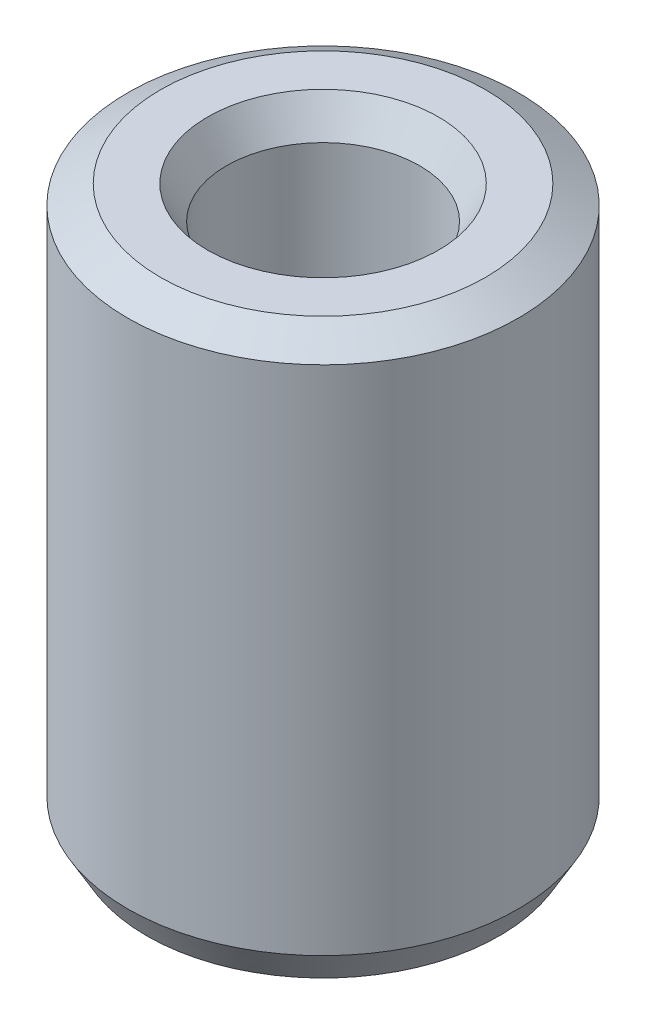
ISO-10303-21;
HEADER;
FILE_DESCRIPTION(('STEP AP214'),'2;1');
FILE_NAME('part.step','',(''),(''),'','','');
FILE_SCHEMA(('AUTOMOTIVE_DESIGN { 1 0 10303 214 1 1 1 1 }'));
ENDSEC;
DATA;
#1=APPLICATION_CONTEXT('core data for automotive mechanical design processes');
#2=APPLICATION_PROTOCOL_DEFINITION('international standard','automotive_design',2000,#1);
#3=PRODUCT_CONTEXT('',#1,'mechanical');
#4=PRODUCT('Part','Part','',(#3));
#5=PRODUCT_RELATED_PRODUCT_CATEGORY('part','',(#4));
#6=PRODUCT_DEFINITION_FORMATION('','',#4);
#7=PRODUCT_DEFINITION_CONTEXT('part definition',#1,'design');
#8=PRODUCT_DEFINITION('design','',#6,#7);
#9=PRODUCT_DEFINITION_SHAPE('','',#8);
#10=(LENGTH_UNIT() NAMED_UNIT(*) SI_UNIT(.MILLI.,.METRE.));
#11=(NAMED_UNIT(*) PLANE_ANGLE_UNIT() SI_UNIT($,.RADIAN.));
#12=(NAMED_UNIT(*) SI_UNIT($,.STERADIAN.) SOLID_ANGLE_UNIT());
#13=UNCERTAINTY_MEASURE_WITH_UNIT(LENGTH_MEASURE(1.E-05),#10,'distance_accuracy_value','');
#14=(GEOMETRIC_REPRESENTATION_CONTEXT(3) GLOBAL_UNCERTAINTY_ASSIGNED_CONTEXT((#13)) GLOBAL_UNIT_ASSIGNED_CONTEXT((#10,
#11,#12)) REPRESENTATION_CONTEXT('',''));
#15=CARTESIAN_POINT('',(0.,0.,0.));
#16=DIRECTION('',(0.,0.,1.));
#17=DIRECTION('',(1.,0.,0.));
#18=AXIS2_PLACEMENT_3D('',#15,#16,#17);
#19=CARTESIAN_POINT('',(0.,43.2676324953821,0.));
#20=DIRECTION('',(0.,-1.,0.));
#21=DIRECTION('',(0.,0.,-1.));
#22=AXIS2_PLACEMENT_3D('',#19,#20,#21);
#23=CYLINDRICAL_SURFACE('',#22,15.);
#24=CARTESIAN_POINT('',(0.,2.51737278887031,0.));
#25=DIRECTION('',(0.,1.,0.));
#26=DIRECTION('',(0.,0.,1.));
#27=AXIS2_PLACEMENT_3D('',#24,#25,#26);
#28=CIRCLE('',#27,15.);
#29=CARTESIAN_POINT('',(0.,2.51737278887031,15.));
#30=VERTEX_POINT('',#29);
#31=EDGE_CURVE('E10',#30,#30,#28,.T.);
#32=ORIENTED_EDGE('',*,*,#31,.T.);
#33=EDGE_LOOP('',(#32));
#34=FACE_BOUND('',#33,.T.);
#35=CARTESIAN_POINT('',(0.,41.8142266380772,0.));
#36=DIRECTION('',(0.,1.,0.));
#37=DIRECTION('',(0.,0.,1.));
#38=AXIS2_PLACEMENT_3D('',#35,#36,#37);
#39=CIRCLE('',#38,15.);
#40=CARTESIAN_POINT('',(0.,41.8142266380772,15.));
#41=VERTEX_POINT('',#40);
#42=EDGE_CURVE('E50',#41,#41,#39,.F.);
#43=ORIENTED_EDGE('',*,*,#42,.T.);
#44=EDGE_LOOP('',(#43));
#45=FACE_BOUND('',#44,.T.);
#46=ADVANCED_FACE('F39',(#34,#45),#23,.T.);
#47=CARTESIAN_POINT('',(0.,43.2676324953821,0.));
#48=DIRECTION('',(0.,1.,0.));
#49=DIRECTION('',(0.,0.,1.));
#50=AXIS2_PLACEMENT_3D('',#47,#48,#49);
#51=PLANE('',#50);
#52=CARTESIAN_POINT('',(0.,43.2676324953821,0.));
#53=DIRECTION('',(0.,1.,0.));
#54=DIRECTION('',(0.,0.,1.));
#55=AXIS2_PLACEMENT_3D('',#52,#53,#54);
#56=CIRCLE('',#55,8.8670238536071);
#57=CARTESIAN_POINT('',(0.,43.2676324953821,8.8670238536071));
#58=VERTEX_POINT('',#57);
#59=EDGE_CURVE('E58',#58,#58,#56,.F.);
#60=ORIENTED_EDGE('',*,*,#59,.T.);
#61=EDGE_LOOP('',(#60));
#62=FACE_BOUND('',#61,.T.);
#63=CARTESIAN_POINT('',(0.,43.2676324953821,0.));
#64=DIRECTION('',(0.,1.,0.));
#65=DIRECTION('',(0.,0.,1.));
#66=AXIS2_PLACEMENT_3D('',#63,#64,#65);
#67=CIRCLE('',#66,12.4826272111297);
#68=CARTESIAN_POINT('',(0.,43.2676324953821,12.4826272111297));
#69=VERTEX_POINT('',#68);
#70=EDGE_CURVE('E61',#69,#69,#67,.T.);
#71=ORIENTED_EDGE('',*,*,#70,.T.);
#72=EDGE_LOOP('',(#71));
#73=FACE_BOUND('',#72,.T.);
#74=ADVANCED_FACE('F88',(#62,#73),#51,.T.);
#75=CARTESIAN_POINT('',(0.,0.,0.));
#76=DIRECTION('',(0.,1.,0.));
#77=DIRECTION('',(0.,0.,1.));
#78=AXIS2_PLACEMENT_3D('',#75,#76,#77);
#79=PLANE('',#78);
#80=CARTESIAN_POINT('',(0.,0.,0.));
#81=DIRECTION('',(0.,1.,0.));
#82=DIRECTION('',(0.,0.,1.));
#83=AXIS2_PLACEMENT_3D('',#80,#81,#82);
#84=CIRCLE('',#83,9.93099078517248);
#85=CARTESIAN_POINT('',(0.,0.,-9.93099078517248));
#86=VERTEX_POINT('',#85);
#87=EDGE_CURVE('E51',#86,#86,#84,.T.);
#88=ORIENTED_EDGE('',*,*,#87,.T.);
#89=EDGE_LOOP('',(#88));
#90=FACE_BOUND('',#89,.T.);
#91=CARTESIAN_POINT('',(0.,0.,0.));
#92=DIRECTION('',(0.,1.,0.));
#93=DIRECTION('',(0.,0.,1.));
#94=AXIS2_PLACEMENT_3D('',#91,#92,#93);
#95=CIRCLE('',#94,13.5465941426951);
#96=CARTESIAN_POINT('',(0.,0.,13.5465941426951));
#97=VERTEX_POINT('',#96);
#98=EDGE_CURVE('E54',#97,#97,#95,.F.);
#99=ORIENTED_EDGE('',*,*,#98,.T.);
#100=EDGE_LOOP('',(#99));
#101=FACE_BOUND('',#100,.T.);
#102=ADVANCED_FACE('F83',(#90,#101),#79,.F.);
#103=CARTESIAN_POINT('',(0.,43.2676324953821,0.));
#104=DIRECTION('',(0.,-1.,0.));
#105=DIRECTION('',(0.,0.,-1.));
#106=AXIS2_PLACEMENT_3D('',#103,#104,#105);
#107=CYLINDRICAL_SURFACE('',#106,7.41361799630217);
#108=CARTESIAN_POINT('',(0.,40.7502597065118,0.));
#109=DIRECTION('',(0.,1.,0.));
#110=DIRECTION('',(0.,0.,1.));
#111=AXIS2_PLACEMENT_3D('',#108,#109,#110);
#112=CIRCLE('',#111,7.41361799630217);
#113=CARTESIAN_POINT('',(0.,40.7502597065118,-7.41361799630217));
#114=VERTEX_POINT('',#113);
#115=EDGE_CURVE('E67',#114,#114,#112,.T.);
#116=CARTESIAN_POINT('',(0.,1.45340585730492,0.));
#117=DIRECTION('',(0.,1.,0.));
#118=DIRECTION('',(0.,0.,1.));
#119=AXIS2_PLACEMENT_3D('',#116,#117,#118);
#120=CIRCLE('',#119,7.41361799630217);
#121=CARTESIAN_POINT('',(0.,1.45340585730491,-7.41361799630217));
#122=VERTEX_POINT('',#121);
#123=EDGE_CURVE('E69',#122,#122,#120,.F.);
#124=CARTESIAN_POINT('',(0.,40.7502597065118,-7.41361799630217));
#125=CARTESIAN_POINT('',(0.,40.3409174789159,-7.41361799630217));
#126=CARTESIAN_POINT('',(0.,39.93157525132,-7.41361799630217));
#127=CARTESIAN_POINT('',(0.,39.1128907961281,-7.41361799630217));
#128=CARTESIAN_POINT('',(0.,38.7035485685322,-7.41361799630217));
#129=CARTESIAN_POINT('',(0.,37.8848641133404,-7.41361799630217));
#130=CARTESIAN_POINT('',(0.,37.4755218857445,-7.41361799630217));
#131=CARTESIAN_POINT('',(0.,36.6568374305527,-7.41361799630217));
#132=CARTESIAN_POINT('',(0.,36.2474952029568,-7.41361799630217));
#133=CARTESIAN_POINT('',(0.,35.428810747765,-7.41361799630217));
#134=CARTESIAN_POINT('',(0.,35.0194685201691,-7.41361799630217));
#135=CARTESIAN_POINT('',(0.,34.2007840649773,-7.41361799630217));
#136=CARTESIAN_POINT('',(0.,33.7914418373814,-7.41361799630217));
#137=CARTESIAN_POINT('',(0.,32.9727573821896,-7.41361799630217));
#138=CARTESIAN_POINT('',(0.,32.5634151545937,-7.41361799630217));
#139=CARTESIAN_POINT('',(0.,31.7447306994019,-7.41361799630217));
#140=CARTESIAN_POINT('',(0.,31.335388471806,-7.41361799630217));
#141=CARTESIAN_POINT('',(0.,30.5167040166141,-7.41361799630217));
#142=CARTESIAN_POINT('',(0.,30.1073617890182,-7.41361799630217));
#143=CARTESIAN_POINT('',(0.,29.2886773338264,-7.41361799630217));
#144=CARTESIAN_POINT('',(0.,28.8793351062305,-7.41361799630217));
#145=CARTESIAN_POINT('',(0.,28.0606506510387,-7.41361799630217));
#146=CARTESIAN_POINT('',(0.,27.6513084234428,-7.41361799630217));
#147=CARTESIAN_POINT('',(0.,26.832623968251,-7.41361799630217));
#148=CARTESIAN_POINT('',(0.,26.4232817406551,-7.41361799630217));
#149=CARTESIAN_POINT('',(0.,25.6045972854633,-7.41361799630217));
#150=CARTESIAN_POINT('',(0.,25.1952550578674,-7.41361799630217));
#151=CARTESIAN_POINT('',(0.,24.3765706026756,-7.41361799630217));
#152=CARTESIAN_POINT('',(0.,23.9672283750797,-7.41361799630217));
#153=CARTESIAN_POINT('',(0.,23.1485439198879,-7.41361799630217));
#154=CARTESIAN_POINT('',(0.,22.739201692292,-7.41361799630217));
#155=CARTESIAN_POINT('',(0.,21.9205172371001,-7.41361799630217));
#156=CARTESIAN_POINT('',(0.,21.5111750095042,-7.41361799630217));
#157=CARTESIAN_POINT('',(0.,20.6924905543124,-7.41361799630217));
#158=CARTESIAN_POINT('',(0.,20.2831483267165,-7.41361799630217));
#159=CARTESIAN_POINT('',(0.,19.4644638715247,-7.41361799630217));
#160=CARTESIAN_POINT('',(0.,19.0551216439288,-7.41361799630217));
#161=CARTESIAN_POINT('',(0.,18.236437188737,-7.41361799630217));
#162=CARTESIAN_POINT('',(0.,17.8270949611411,-7.41361799630217));
#163=CARTESIAN_POINT('',(0.,17.0084105059493,-7.41361799630217));
#164=CARTESIAN_POINT('',(0.,16.5990682783534,-7.41361799630217));
#165=CARTESIAN_POINT('',(0.,15.7803838231616,-7.41361799630217));
#166=CARTESIAN_POINT('',(0.,15.3710415955657,-7.41361799630217));
#167=CARTESIAN_POINT('',(0.,14.5523571403739,-7.41361799630217));
#168=CARTESIAN_POINT('',(0.,14.143014912778,-7.41361799630217));
#169=CARTESIAN_POINT('',(0.,13.3243304575861,-7.41361799630217));
#170=CARTESIAN_POINT('',(0.,12.9149882299902,-7.41361799630217));
#171=CARTESIAN_POINT('',(0.,12.0963037747984,-7.41361799630217));
#172=CARTESIAN_POINT('',(0.,11.6869615472025,-7.41361799630217));
#173=CARTESIAN_POINT('',(0.,10.8682770920107,-7.41361799630217));
#174=CARTESIAN_POINT('',(0.,10.4589348644148,-7.41361799630217));
#175=CARTESIAN_POINT('',(0.,9.640250409223,-7.41361799630217));
#176=CARTESIAN_POINT('',(0.,9.2309081816271,-7.41361799630217));
#177=CARTESIAN_POINT('',(0.,8.41222372643529,-7.41361799630217));
#178=CARTESIAN_POINT('',(0.,8.00288149883938,-7.41361799630217));
#179=CARTESIAN_POINT('',(0.,7.18419704364757,-7.41361799630217));
#180=CARTESIAN_POINT('',(0.,6.77485481605167,-7.41361799630217));
#181=CARTESIAN_POINT('',(0.,5.95617036085986,-7.41361799630217));
#182=CARTESIAN_POINT('',(0.,5.54682813326396,-7.41361799630217));
#183=CARTESIAN_POINT('',(0.,4.72814367807215,-7.41361799630217));
#184=CARTESIAN_POINT('',(0.,4.31880145047625,-7.41361799630217));
#185=CARTESIAN_POINT('',(0.,3.50011699528444,-7.41361799630217));
#186=CARTESIAN_POINT('',(0.,3.09077476768853,-7.41361799630217));
#187=CARTESIAN_POINT('',(0.,2.27209031249672,-7.41361799630217));
#188=CARTESIAN_POINT('',(0.,1.86274808490082,-7.41361799630217));
#189=CARTESIAN_POINT('',(0.,1.45340585730491,-7.41361799630217));
#190=B_SPLINE_CURVE_WITH_KNOTS('',3,(#124,#125,#126,#127,#128,#129,#130,#131,#132,#133,#134,
#135,#136,#137,#138,#139,#140,#141,#142,#143,#144,#145,#146,#147,#148,#149,#150,#151,#152,#153,
#154,#155,#156,#157,#158,#159,#160,#161,#162,#163,#164,#165,#166,#167,#168,#169,#170,#171,#172,
#173,#174,#175,#176,#177,#178,#179,#180,#181,#182,#183,#184,#185,#186,#187,#188,#189),
.UNSPECIFIED.,.F.,.F.,(4,2,2,2,2,2,2,2,2,2,2,2,2,2,2,2,2,2,2,2,2,2,2,2,2,2,2,2,2,2,2,2,4),(0.,
1.22802668278772,2.45605336557543,3.68408004836315,4.91210673115086,6.14013341393857,
7.36816009672629,8.596186779514,9.82421346230172,11.0522401450894,12.2802668278771,
13.5082935106649,14.7363201934526,15.9643468762403,17.192373559028,18.4204002418157,
19.6484269246034,20.8764536073911,22.1044802901789,23.3325069729666,24.5605336557543,
25.788560338542,27.0165870213297,28.2446137041174,29.4726403869051,30.7006670696929,
31.9286937524806,33.1567204352683,34.384747118056,35.6127738008437,36.8408004836314,
38.0688271664191,39.2968538492068),.UNSPECIFIED.);
#191=EDGE_CURVE('BSEAM71',#114,#122,#190,.T.);
#192=ORIENTED_EDGE('',*,*,#115,.T.);
#193=ORIENTED_EDGE('',*,*,#123,.T.);
#194=ORIENTED_EDGE('',*,*,#191,.T.);
#195=ORIENTED_EDGE('',*,*,#191,.F.);
#196=EDGE_LOOP('',(#192,#194,#193,#195));
#197=FACE_BOUND('',#196,.T.);
#198=ADVANCED_FACE('F71',(#197),#107,.F.);
#199=CARTESIAN_POINT('',(0.,40.7502597065118,0.));
#200=DIRECTION('',(0.,1.,0.));
#201=DIRECTION('',(0.,0.,1.));
#202=AXIS2_PLACEMENT_3D('',#199,#200,#201);
#203=CONICAL_SURFACE('',#202,7.41361799630217,0.523598775598304);
#204=ORIENTED_EDGE('',*,*,#59,.F.);
#205=EDGE_LOOP('',(#204));
#206=FACE_BOUND('',#205,.T.);
#207=ORIENTED_EDGE('',*,*,#115,.F.);
#208=EDGE_LOOP('',(#207));
#209=FACE_BOUND('',#208,.T.);
#210=ADVANCED_FACE('F77',(#206,#209),#203,.F.);
#211=CARTESIAN_POINT('',(0.,0.,0.));
#212=DIRECTION('',(0.,-1.,0.));
#213=DIRECTION('',(0.,0.,-1.));
#214=AXIS2_PLACEMENT_3D('',#211,#212,#213);
#215=CONICAL_SURFACE('',#214,9.93099078517248,1.0471975511966);
#216=CARTESIAN_POINT('',(0.,1.45340585730492,-7.41361799630217));
#217=CARTESIAN_POINT('',(0.,1.43826621295799,-7.43984062951957));
#218=CARTESIAN_POINT('',(0.,1.42312656861107,-7.46606326273697));
#219=CARTESIAN_POINT('',(0.,1.39284727991721,-7.51850852917176));
#220=CARTESIAN_POINT('',(0.,1.37770763557029,-7.54473116238916));
#221=CARTESIAN_POINT('',(0.,1.34742834687644,-7.59717642882396));
#222=CARTESIAN_POINT('',(0.,1.33228870252951,-7.62339906204136));
#223=CARTESIAN_POINT('',(0.,1.30200941383566,-7.67584432847616));
#224=CARTESIAN_POINT('',(0.,1.28686976948873,-7.70206696169356));
#225=CARTESIAN_POINT('',(0.,1.25659048079488,-7.75451222812836));
#226=CARTESIAN_POINT('',(0.,1.24145083644795,-7.78073486134576));
#227=CARTESIAN_POINT('',(0.,1.2111715477541,-7.83318012778055));
#228=CARTESIAN_POINT('',(0.,1.19603190340717,-7.85940276099795));
#229=CARTESIAN_POINT('',(0.,1.16575261471332,-7.91184802743275));
#230=CARTESIAN_POINT('',(0.,1.15061297036639,-7.93807066065015));
#231=CARTESIAN_POINT('',(0.,1.12033368167254,-7.99051592708495));
#232=CARTESIAN_POINT('',(0.,1.10519403732562,-8.01673856030235));
#233=CARTESIAN_POINT('',(0.,1.07491474863176,-8.06918382673715));
#234=CARTESIAN_POINT('',(0.,1.05977510428484,-8.09540645995454));
#235=CARTESIAN_POINT('',(0.,1.02949581559098,-8.14785172638934));
#236=CARTESIAN_POINT('',(0.,1.01435617124406,-8.17407435960674));
#237=CARTESIAN_POINT('',(0.,0.984076882550206,-8.22651962604154));
#238=CARTESIAN_POINT('',(0.,0.96893723820328,-8.25274225925894));
#239=CARTESIAN_POINT('',(0.,0.938657949509427,-8.30518752569374));
#240=CARTESIAN_POINT('',(0.,0.923518305162501,-8.33141015891113));
#241=CARTESIAN_POINT('',(0.,0.893239016468648,-8.38385542534593));
#242=CARTESIAN_POINT('',(0.,0.878099372121722,-8.41007805856333));
#243=CARTESIAN_POINT('',(0.,0.84782008342787,-8.46252332499813));
#244=CARTESIAN_POINT('',(0.,0.832680439080943,-8.48874595821553));
#245=CARTESIAN_POINT('',(0.,0.802401150387091,-8.54119122465033));
#246=CARTESIAN_POINT('',(0.,0.787261506040165,-8.56741385786773));
#247=CARTESIAN_POINT('',(0.,0.756982217346312,-8.61985912430253));
#248=CARTESIAN_POINT('',(0.,0.741842572999386,-8.64608175751992));
#249=CARTESIAN_POINT('',(0.,0.711563284305534,-8.69852702395472));
#250=CARTESIAN_POINT('',(0.,0.696423639958607,-8.72474965717212));
#251=CARTESIAN_POINT('',(0.,0.666144351264754,-8.77719492360692));
#252=CARTESIAN_POINT('',(0.,0.651004706917828,-8.80341755682432));
#253=CARTESIAN_POINT('',(0.,0.620725418223976,-8.85586282325912));
#254=CARTESIAN_POINT('',(0.,0.60558577387705,-8.88208545647651));
#255=CARTESIAN_POINT('',(0.,0.575306485183197,-8.93453072291131));
#256=CARTESIAN_POINT('',(0.,0.560166840836271,-8.96075335612871));
#257=CARTESIAN_POINT('',(0.,0.529887552142419,-9.01319862256351));
#258=CARTESIAN_POINT('',(0.,0.514747907795492,-9.03942125578091));
#259=CARTESIAN_POINT('',(0.,0.48446861910164,-9.09186652221571));
#260=CARTESIAN_POINT('',(0.,0.469328974754713,-9.11808915543311));
#261=CARTESIAN_POINT('',(0.,0.439049686060861,-9.1705344218679));
#262=CARTESIAN_POINT('',(0.,0.423910041713935,-9.1967570550853));
#263=CARTESIAN_POINT('',(0.,0.393630753020082,-9.2492023215201));
#264=CARTESIAN_POINT('',(0.,0.378491108673156,-9.2754249547375));
#265=CARTESIAN_POINT('',(0.,0.348211819979304,-9.3278702211723));
#266=CARTESIAN_POINT('',(0.,0.333072175632377,-9.3540928543897));
#267=CARTESIAN_POINT('',(0.,0.302792886938525,-9.40653812082449));
#268=CARTESIAN_POINT('',(0.,0.287653242591598,-9.4327607540419));
#269=CARTESIAN_POINT('',(0.,0.257373953897746,-9.48520602047669));
#270=CARTESIAN_POINT('',(0.,0.24223430955082,-9.51142865369409));
#271=CARTESIAN_POINT('',(0.,0.211955020856967,-9.56387392012889));
#272=CARTESIAN_POINT('',(0.,0.196815376510041,-9.59009655334629));
#273=CARTESIAN_POINT('',(0.,0.166536087816189,-9.64254181978109));
#274=CARTESIAN_POINT('',(0.,0.151396443469263,-9.66876445299849));
#275=CARTESIAN_POINT('',(0.,0.12111715477541,-9.72120971943328));
#276=CARTESIAN_POINT('',(0.,0.105977510428484,-9.74743235265068));
#277=CARTESIAN_POINT('',(0.,0.075698221734631,-9.79987761908548));
#278=CARTESIAN_POINT('',(0.,0.0605585773877049,-9.82610025230288));
#279=CARTESIAN_POINT('',(0.,0.0302792886938526,-9.87854551873768));
#280=CARTESIAN_POINT('',(0.,0.0151396443469264,-9.90476815195508));
#281=CARTESIAN_POINT('',(0.,0.,-9.93099078517248));
#282=B_SPLINE_CURVE_WITH_KNOTS('',3,(#216,#217,#218,#219,#220,#221,#222,#223,#224,#225,#226,
#227,#228,#229,#230,#231,#232,#233,#234,#235,#236,#237,#238,#239,#240,#241,#242,#243,#244,#245,
#246,#247,#248,#249,#250,#251,#252,#253,#254,#255,#256,#257,#258,#259,#260,#261,#262,#263,#264,
#265,#266,#267,#268,#269,#270,#271,#272,#273,#274,#275,#276,#277,#278,#279,#280,#281),
.UNSPECIFIED.,.F.,.F.,(4,2,2,2,2,2,2,2,2,2,2,2,2,2,2,2,2,2,2,2,2,2,2,2,2,2,2,2,2,2,2,2,4),(0.,
0.0908378660815574,0.181675732163115,0.272513598244671,0.363351464326228,0.454189330407786,
0.545027196489343,0.6358650625709,0.726702928652456,0.817540794734014,0.908378660815571,
0.999216526897129,1.09005439297868,1.18089225906024,1.2717301251418,1.36256799122336,
1.45340585730491,1.54424372338647,1.63508158946803,1.72591945554959,1.81675732163114,
1.9075951877127,1.99843305379426,2.08927091987581,2.18010878595737,2.27094665203893,
2.36178451812048,2.45262238420204,2.5434602502836,2.63429811636516,2.72513598244671,
2.81597384852827,2.90681171460983),.UNSPECIFIED.);
#283=EDGE_CURVE('BSEAM73',#122,#86,#282,.T.);
#284=ORIENTED_EDGE('',*,*,#123,.F.);
#285=ORIENTED_EDGE('',*,*,#87,.F.);
#286=ORIENTED_EDGE('',*,*,#283,.T.);
#287=ORIENTED_EDGE('',*,*,#283,.F.);
#288=EDGE_LOOP('',(#284,#286,#285,#287));
#289=FACE_BOUND('',#288,.T.);
#290=ADVANCED_FACE('F73',(#289),#215,.F.);
#291=CARTESIAN_POINT('',(0.,2.51737278887031,0.));
#292=DIRECTION('',(0.,1.,0.));
#293=DIRECTION('',(0.,0.,1.));
#294=AXIS2_PLACEMENT_3D('',#291,#292,#293);
#295=CONICAL_SURFACE('',#294,15.,0.523598775598303);
#296=CARTESIAN_POINT('',(0.,0.,13.5465941426951));
#297=CARTESIAN_POINT('',(0.,0.0262226332173986,13.561733787042));
#298=CARTESIAN_POINT('',(0.,0.0524452664347976,13.5768734313889));
#299=CARTESIAN_POINT('',(0.,0.104890532869596,13.6071527200828));
#300=CARTESIAN_POINT('',(0.,0.131113166086995,13.6222923644297));
#301=CARTESIAN_POINT('',(0.,0.183558432521793,13.6525716531236));
#302=CARTESIAN_POINT('',(0.,0.209781065739192,13.6677112974705));
#303=CARTESIAN_POINT('',(0.,0.26222633217399,13.6979905861643));
#304=CARTESIAN_POINT('',(0.,0.288448965391389,13.7131302305113));
#305=CARTESIAN_POINT('',(0.,0.340894231826187,13.7434095192051));
#306=CARTESIAN_POINT('',(0.,0.367116865043586,13.758549163552));
#307=CARTESIAN_POINT('',(0.,0.419562131478384,13.7888284522459));
#308=CARTESIAN_POINT('',(0.,0.445784764695783,13.8039680965928));
#309=CARTESIAN_POINT('',(0.,0.498230031130581,13.8342473852867));
#310=CARTESIAN_POINT('',(0.,0.52445266434798,13.8493870296336));
#311=CARTESIAN_POINT('',(0.,0.576897930782778,13.8796663183275));
#312=CARTESIAN_POINT('',(0.,0.603120564000177,13.8948059626744));
#313=CARTESIAN_POINT('',(0.,0.655565830434975,13.9250852513682));
#314=CARTESIAN_POINT('',(0.,0.681788463652374,13.9402248957152));
#315=CARTESIAN_POINT('',(0.,0.734233730087172,13.970504184409));
#316=CARTESIAN_POINT('',(0.,0.760456363304571,13.9856438287559));
#317=CARTESIAN_POINT('',(0.,0.812901629739369,14.0159231174498));
#318=CARTESIAN_POINT('',(0.,0.839124262956768,14.0310627617967));
#319=CARTESIAN_POINT('',(0.,0.891569529391567,14.0613420504906));
#320=CARTESIAN_POINT('',(0.,0.917792162608966,14.0764816948375));
#321=CARTESIAN_POINT('',(0.,0.970237429043764,14.1067609835313));
#322=CARTESIAN_POINT('',(0.,0.996460062261163,14.1219006278783));
#323=CARTESIAN_POINT('',(0.,1.04890532869596,14.1521799165721));
#324=CARTESIAN_POINT('',(0.,1.07512796191336,14.1673195609191));
#325=CARTESIAN_POINT('',(0.,1.12757322834816,14.1975988496129));
#326=CARTESIAN_POINT('',(0.,1.15379586156556,14.2127384939598));
#327=CARTESIAN_POINT('',(0.,1.20624112800035,14.2430177826537));
#328=CARTESIAN_POINT('',(0.,1.23246376121775,14.2581574270006));
#329=CARTESIAN_POINT('',(0.,1.28490902765255,14.2884367156945));
#330=CARTESIAN_POINT('',(0.,1.31113166086995,14.3035763600414));
#331=CARTESIAN_POINT('',(0.,1.36357692730475,14.3338556487352));
#332=CARTESIAN_POINT('',(0.,1.38979956052215,14.3489952930822));
#333=CARTESIAN_POINT('',(0.,1.44224482695695,14.379274581776));
#334=CARTESIAN_POINT('',(0.,1.46846746017435,14.3944142261229));
#335=CARTESIAN_POINT('',(0.,1.52091272660914,14.4246935148168));
#336=CARTESIAN_POINT('',(0.,1.54713535982654,14.4398331591637));
#337=CARTESIAN_POINT('',(0.,1.59958062626134,14.4701124478576));
#338=CARTESIAN_POINT('',(0.,1.62580325947874,14.4852520922045));
#339=CARTESIAN_POINT('',(0.,1.67824852591354,14.5155313808984));
#340=CARTESIAN_POINT('',(0.,1.70447115913094,14.5306710252453));
#341=CARTESIAN_POINT('',(0.,1.75691642556573,14.5609503139391));
#342=CARTESIAN_POINT('',(0.,1.78313905878313,14.5760899582861));
#343=CARTESIAN_POINT('',(0.,1.83558432521793,14.6063692469799));
#344=CARTESIAN_POINT('',(0.,1.86180695843533,14.6215088913268));
#345=CARTESIAN_POINT('',(0.,1.91425222487013,14.6517881800207));
#346=CARTESIAN_POINT('',(0.,1.94047485808753,14.6669278243676));
#347=CARTESIAN_POINT('',(0.,1.99292012452233,14.6972071130615));
#348=CARTESIAN_POINT('',(0.,2.01914275773972,14.7123467574084));
#349=CARTESIAN_POINT('',(0.,2.07158802417452,14.7426260461023));
#350=CARTESIAN_POINT('',(0.,2.09781065739192,14.7577656904492));
#351=CARTESIAN_POINT('',(0.,2.15025592382672,14.788044979143));
#352=CARTESIAN_POINT('',(0.,2.17647855704412,14.80318462349));
#353=CARTESIAN_POINT('',(0.,2.22892382347892,14.8334639121838));
#354=CARTESIAN_POINT('',(0.,2.25514645669632,14.8486035565307));
#355=CARTESIAN_POINT('',(0.,2.30759172313111,14.8788828452246));
#356=CARTESIAN_POINT('',(0.,2.33381435634851,14.8940224895715));
#357=CARTESIAN_POINT('',(0.,2.38625962278331,14.9243017782654));
#358=CARTESIAN_POINT('',(0.,2.41248225600071,14.9394414226123));
#359=CARTESIAN_POINT('',(0.,2.46492752243551,14.9697207113061));
#360=CARTESIAN_POINT('',(0.,2.49115015565291,14.9848603556531));
#361=CARTESIAN_POINT('',(0.,2.51737278887031,15.));
#362=B_SPLINE_CURVE_WITH_KNOTS('',3,(#296,#297,#298,#299,#300,#301,#302,#303,#304,#305,#306,
#307,#308,#309,#310,#311,#312,#313,#314,#315,#316,#317,#318,#319,#320,#321,#322,#323,#324,#325,
#326,#327,#328,#329,#330,#331,#332,#333,#334,#335,#336,#337,#338,#339,#340,#341,#342,#343,#344,
#345,#346,#347,#348,#349,#350,#351,#352,#353,#354,#355,#356,#357,#358,#359,#360,#361),
.UNSPECIFIED.,.F.,.F.,(4,2,2,2,2,2,2,2,2,2,2,2,2,2,2,2,2,2,2,2,2,2,2,2,2,2,2,2,2,2,2,2,4),(0.,
0.0908378660815569,0.181675732163114,0.272513598244671,0.363351464326228,0.454189330407785,
0.545027196489342,0.6358650625709,0.726702928652456,0.817540794734013,0.908378660815571,
0.999216526897128,1.09005439297868,1.18089225906024,1.2717301251418,1.36256799122336,
1.45340585730491,1.54424372338647,1.63508158946803,1.72591945554958,1.81675732163114,
1.9075951877127,1.99843305379426,2.08927091987581,2.18010878595737,2.27094665203893,
2.36178451812049,2.45262238420204,2.5434602502836,2.63429811636516,2.72513598244671,
2.81597384852827,2.90681171460983),.UNSPECIFIED.);
#363=EDGE_CURVE('BSEAM76',#97,#30,#362,.T.);
#364=ORIENTED_EDGE('',*,*,#98,.F.);
#365=ORIENTED_EDGE('',*,*,#31,.F.);
#366=ORIENTED_EDGE('',*,*,#363,.T.);
#367=ORIENTED_EDGE('',*,*,#363,.F.);
#368=EDGE_LOOP('',(#364,#366,#365,#367));
#369=FACE_BOUND('',#368,.T.);
#370=ADVANCED_FACE('F76',(#369),#295,.T.);
#371=CARTESIAN_POINT('',(0.,43.2676324953821,0.));
#372=DIRECTION('',(0.,-1.,0.));
#373=DIRECTION('',(0.,0.,-1.));
#374=AXIS2_PLACEMENT_3D('',#371,#372,#373);
#375=CONICAL_SURFACE('',#374,12.4826272111297,1.0471975511966);
#376=ORIENTED_EDGE('',*,*,#42,.F.);
#377=EDGE_LOOP('',(#376));
#378=FACE_BOUND('',#377,.T.);
#379=ORIENTED_EDGE('',*,*,#70,.F.);
#380=EDGE_LOOP('',(#379));
#381=FACE_BOUND('',#380,.T.);
#382=ADVANCED_FACE('F45',(#378,#381),#375,.T.);
#383=CLOSED_SHELL('',(#46,#74,#102,#198,#210,#290,#370,#382));
#384=MANIFOLD_SOLID_BREP('B2',#383);
#385=ADVANCED_BREP_SHAPE_REPRESENTATION('',(#18,#384),#14);
#386=SHAPE_DEFINITION_REPRESENTATION(#9,#385);
ENDSEC;
END-ISO-10303-21;
